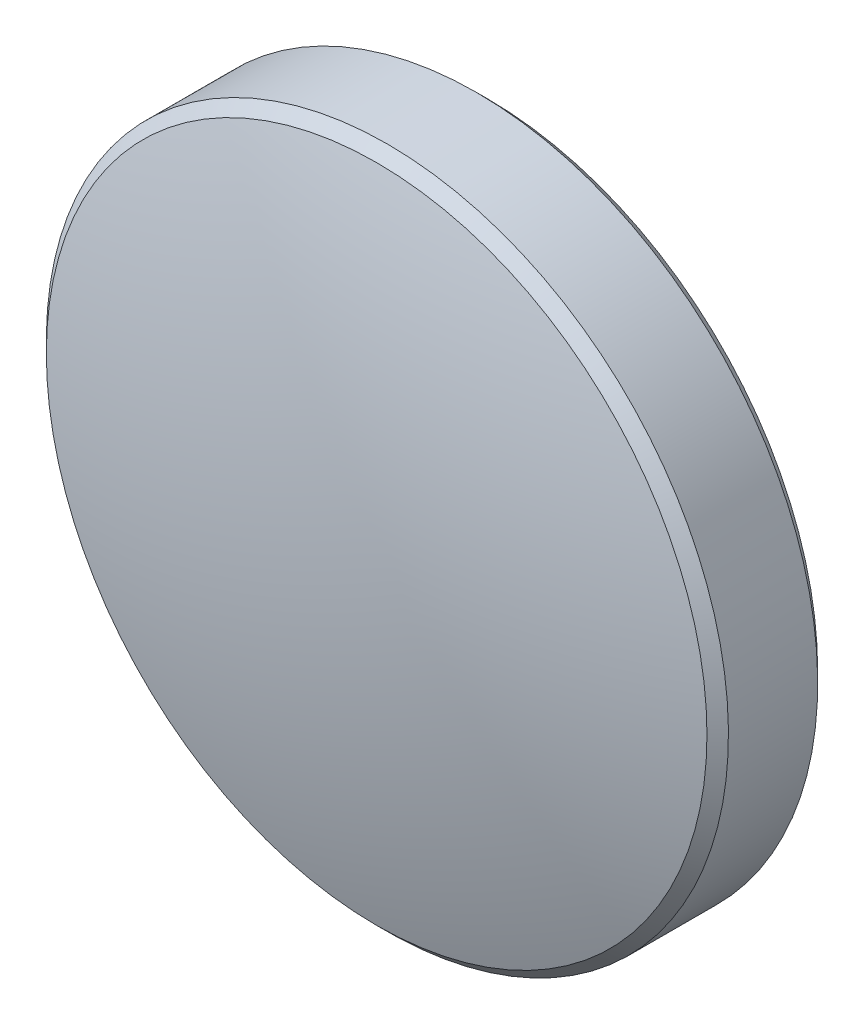
ISO-10303-21;
HEADER;
FILE_DESCRIPTION(('STEP AP214'),'2;1');
FILE_NAME('part.step','',(''),(''),'','','');
FILE_SCHEMA(('AUTOMOTIVE_DESIGN { 1 0 10303 214 1 1 1 1 }'));
ENDSEC;
DATA;
#1=APPLICATION_CONTEXT('core data for automotive mechanical design processes');
#2=APPLICATION_PROTOCOL_DEFINITION('international standard','automotive_design',2000,#1);
#3=PRODUCT_CONTEXT('',#1,'mechanical');
#4=PRODUCT('Part','Part','',(#3));
#5=PRODUCT_RELATED_PRODUCT_CATEGORY('part','',(#4));
#6=PRODUCT_DEFINITION_FORMATION('','',#4);
#7=PRODUCT_DEFINITION_CONTEXT('part definition',#1,'design');
#8=PRODUCT_DEFINITION('design','',#6,#7);
#9=PRODUCT_DEFINITION_SHAPE('','',#8);
#10=(LENGTH_UNIT() NAMED_UNIT(*) SI_UNIT(.MILLI.,.METRE.));
#11=(NAMED_UNIT(*) PLANE_ANGLE_UNIT() SI_UNIT($,.RADIAN.));
#12=(NAMED_UNIT(*) SI_UNIT($,.STERADIAN.) SOLID_ANGLE_UNIT());
#13=UNCERTAINTY_MEASURE_WITH_UNIT(LENGTH_MEASURE(1.E-05),#10,'distance_accuracy_value','');
#14=(GEOMETRIC_REPRESENTATION_CONTEXT(3) GLOBAL_UNCERTAINTY_ASSIGNED_CONTEXT((#13)) GLOBAL_UNIT_ASSIGNED_CONTEXT((#10,
#11,#12)) REPRESENTATION_CONTEXT('',''));
#15=CARTESIAN_POINT('',(0.,0.,0.));
#16=DIRECTION('',(0.,0.,1.));
#17=DIRECTION('',(1.,0.,0.));
#18=AXIS2_PLACEMENT_3D('',#15,#16,#17);
#19=CARTESIAN_POINT('',(0.,0.,-1.49));
#20=DIRECTION('',(0.,0.,-1.));
#21=DIRECTION('',(0.,1.,0.));
#22=AXIS2_PLACEMENT_3D('',#19,#20,#21);
#23=CYLINDRICAL_SURFACE('',#22,6.35);
#24=CARTESIAN_POINT('',(0.,0.,0.371110804326906));
#25=DIRECTION('',(0.,0.,-1.));
#26=DIRECTION('',(0.,1.,0.));
#27=AXIS2_PLACEMENT_3D('',#24,#25,#26);
#28=CIRCLE('',#27,6.34999999999999);
#29=CARTESIAN_POINT('',(0.,6.35,0.371110804326897));
#30=VERTEX_POINT('',#29);
#31=EDGE_CURVE('E24',#30,#30,#28,.T.);
#32=ORIENTED_EDGE('',*,*,#31,.T.);
#33=EDGE_LOOP('',(#32));
#34=FACE_BOUND('',#33,.T.);
#35=CARTESIAN_POINT('',(0.,0.,-1.28999999999999));
#36=DIRECTION('',(0.,0.,-1.));
#37=DIRECTION('',(0.,1.,0.));
#38=AXIS2_PLACEMENT_3D('',#35,#36,#37);
#39=CIRCLE('',#38,6.35);
#40=CARTESIAN_POINT('',(0.,6.35,-1.29));
#41=VERTEX_POINT('',#40);
#42=EDGE_CURVE('E20',#41,#41,#39,.T.);
#43=ORIENTED_EDGE('',*,*,#42,.F.);
#44=EDGE_LOOP('',(#43));
#45=FACE_BOUND('',#44,.T.);
#46=ADVANCED_FACE('F13',(#34,#45),#23,.T.);
#47=CARTESIAN_POINT('',(0.,0.,-1.28999999999999));
#48=DIRECTION('',(0.,0.,1.));
#49=DIRECTION('',(0.,-1.,0.));
#50=AXIS2_PLACEMENT_3D('',#47,#48,#49);
#51=CONICAL_SURFACE('',#50,6.35,0.785398163397447);
#52=CARTESIAN_POINT('',(0.,0.,-1.48999999999999));
#53=DIRECTION('',(0.,0.,-1.));
#54=DIRECTION('',(0.,1.,0.));
#55=AXIS2_PLACEMENT_3D('',#52,#53,#54);
#56=CIRCLE('',#55,6.15);
#57=CARTESIAN_POINT('',(0.,6.15,-1.49));
#58=VERTEX_POINT('',#57);
#59=EDGE_CURVE('E9',#58,#58,#56,.T.);
#60=ORIENTED_EDGE('',*,*,#59,.F.);
#61=EDGE_LOOP('',(#60));
#62=FACE_BOUND('',#61,.T.);
#63=ORIENTED_EDGE('',*,*,#42,.T.);
#64=EDGE_LOOP('',(#63));
#65=FACE_BOUND('',#64,.T.);
#66=ADVANCED_FACE('F46',(#62,#65),#51,.T.);
#67=CARTESIAN_POINT('',(0.,0.,-1.49));
#68=DIRECTION('',(0.,0.,-1.));
#69=DIRECTION('',(0.,1.,0.));
#70=AXIS2_PLACEMENT_3D('',#67,#68,#69);
#71=PLANE('',#70);
#72=ORIENTED_EDGE('',*,*,#59,.T.);
#73=EDGE_LOOP('',(#72));
#74=FACE_BOUND('',#73,.T.);
#75=ADVANCED_FACE('F15',(#74),#71,.T.);
#76=CARTESIAN_POINT('',(0.,0.,0.571110804326905));
#77=DIRECTION('',(0.,0.,-1.));
#78=DIRECTION('',(0.,1.,0.));
#79=AXIS2_PLACEMENT_3D('',#76,#77,#78);
#80=CONICAL_SURFACE('',#79,6.15,0.785398163397446);
#81=ORIENTED_EDGE('',*,*,#31,.F.);
#82=EDGE_LOOP('',(#81));
#83=FACE_BOUND('',#82,.T.);
#84=CARTESIAN_POINT('',(0.,0.,0.571110804326905));
#85=DIRECTION('',(0.,0.,-1.));
#86=DIRECTION('',(0.,1.,0.));
#87=AXIS2_PLACEMENT_3D('',#84,#85,#86);
#88=CIRCLE('',#87,6.15);
#89=CARTESIAN_POINT('',(0.,6.15,0.571110804326897));
#90=VERTEX_POINT('',#89);
#91=EDGE_CURVE('E28',#90,#90,#88,.T.);
#92=ORIENTED_EDGE('',*,*,#91,.T.);
#93=EDGE_LOOP('',(#92));
#94=FACE_BOUND('',#93,.T.);
#95=ADVANCED_FACE('F34',(#83,#94),#80,.T.);
#96=CARTESIAN_POINT('',(0.,0.,-19.5500000000002));
#97=DIRECTION('',(0.,0.,-1.));
#98=DIRECTION('',(0.,1.,0.));
#99=AXIS2_PLACEMENT_3D('',#96,#97,#98);
#100=SPHERICAL_SURFACE('',#99,21.0400000000002);
#101=ORIENTED_EDGE('',*,*,#91,.F.);
#102=EDGE_LOOP('',(#101));
#103=FACE_BOUND('',#102,.T.);
#104=ADVANCED_FACE('F36',(#103),#100,.T.);
#105=CLOSED_SHELL('',(#46,#66,#75,#95,#104));
#106=MANIFOLD_SOLID_BREP('B1',#105);
#107=ADVANCED_BREP_SHAPE_REPRESENTATION('',(#18,#106),#14);
#108=SHAPE_DEFINITION_REPRESENTATION(#9,#107);
ENDSEC;
END-ISO-10303-21;
